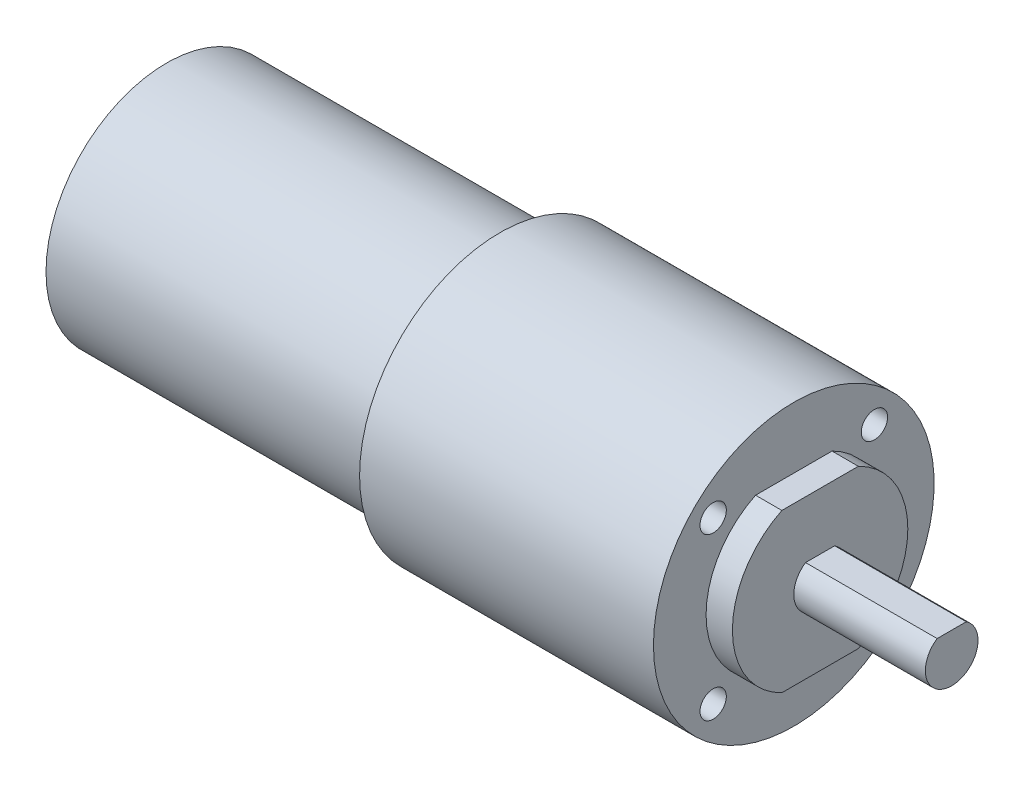
ISO-10303-21;
HEADER;
FILE_DESCRIPTION(('STEP AP214'),'2;1');
FILE_NAME('part.step','',(''),(''),'','','');
FILE_SCHEMA(('AUTOMOTIVE_DESIGN { 1 0 10303 214 1 1 1 1 }'));
ENDSEC;
DATA;
#1=APPLICATION_CONTEXT('core data for automotive mechanical design processes');
#2=APPLICATION_PROTOCOL_DEFINITION('international standard','automotive_design',2000,#1);
#3=PRODUCT_CONTEXT('',#1,'mechanical');
#4=PRODUCT('Part','Part','',(#3));
#5=PRODUCT_RELATED_PRODUCT_CATEGORY('part','',(#4));
#6=PRODUCT_DEFINITION_FORMATION('','',#4);
#7=PRODUCT_DEFINITION_CONTEXT('part definition',#1,'design');
#8=PRODUCT_DEFINITION('design','',#6,#7);
#9=PRODUCT_DEFINITION_SHAPE('','',#8);
#10=(LENGTH_UNIT() NAMED_UNIT(*) SI_UNIT(.MILLI.,.METRE.));
#11=(NAMED_UNIT(*) PLANE_ANGLE_UNIT() SI_UNIT($,.RADIAN.));
#12=(NAMED_UNIT(*) SI_UNIT($,.STERADIAN.) SOLID_ANGLE_UNIT());
#13=UNCERTAINTY_MEASURE_WITH_UNIT(LENGTH_MEASURE(1.E-05),#10,'distance_accuracy_value','');
#14=(GEOMETRIC_REPRESENTATION_CONTEXT(3) GLOBAL_UNCERTAINTY_ASSIGNED_CONTEXT((#13)) GLOBAL_UNIT_ASSIGNED_CONTEXT((#10,
#11,#12)) REPRESENTATION_CONTEXT('',''));
#15=CARTESIAN_POINT('',(0.,0.,0.));
#16=DIRECTION('',(0.,0.,1.));
#17=DIRECTION('',(1.,0.,0.));
#18=AXIS2_PLACEMENT_3D('',#15,#16,#17);
#19=CARTESIAN_POINT('',(-42.475,0.,0.));
#20=DIRECTION('',(-1.,0.,0.));
#21=DIRECTION('',(0.,0.,1.));
#22=AXIS2_PLACEMENT_3D('',#19,#20,#21);
#23=CYLINDRICAL_SURFACE('',#22,10.);
#24=CARTESIAN_POINT('',(36.5,0.,0.));
#25=DIRECTION('',(-1.,0.,0.));
#26=DIRECTION('',(0.,0.,1.));
#27=AXIS2_PLACEMENT_3D('',#24,#25,#26);
#28=CIRCLE('',#27,10.);
#29=CARTESIAN_POINT('',(36.5,9.,-4.35889894354069));
#30=VERTEX_POINT('',#29);
#31=CARTESIAN_POINT('',(36.5,-9.,-4.35889894354069));
#32=VERTEX_POINT('',#31);
#33=EDGE_CURVE('E102',#30,#32,#28,.T.);
#34=ORIENTED_EDGE('',*,*,#33,.T.);
#35=DIRECTION('',(1.,0.,0.));
#36=VECTOR('',#35,1.);
#37=CARTESIAN_POINT('',(24.7250356126079,-9.,-4.35889894354069));
#38=LINE('',#37,#36);
#39=CARTESIAN_POINT('',(33.5,-9.,-4.35889894354069));
#40=VERTEX_POINT('',#39);
#41=EDGE_CURVE('E55',#40,#32,#38,.T.);
#42=ORIENTED_EDGE('',*,*,#41,.F.);
#43=CARTESIAN_POINT('',(33.5,0.,0.));
#44=DIRECTION('',(-1.,0.,0.));
#45=DIRECTION('',(0.,0.,1.));
#46=AXIS2_PLACEMENT_3D('',#43,#44,#45);
#47=CIRCLE('',#46,10.);
#48=CARTESIAN_POINT('',(33.5,9.,-4.35889894354069));
#49=VERTEX_POINT('',#48);
#50=EDGE_CURVE('E110',#49,#40,#47,.T.);
#51=ORIENTED_EDGE('',*,*,#50,.F.);
#52=DIRECTION('',(1.,0.,0.));
#53=VECTOR('',#52,1.);
#54=CARTESIAN_POINT('',(24.7250356126079,9.,-4.35889894354069));
#55=LINE('',#54,#53);
#56=EDGE_CURVE('E150',#49,#30,#55,.T.);
#57=ORIENTED_EDGE('',*,*,#56,.T.);
#58=EDGE_LOOP('',(#34,#42,#51,#57));
#59=FACE_BOUND('',#58,.T.);
#60=ADVANCED_FACE('F32',(#59),#23,.T.);
#61=CARTESIAN_POINT('',(-38.,0.,0.));
#62=DIRECTION('',(1.,0.,0.));
#63=DIRECTION('',(0.,0.,-1.));
#64=AXIS2_PLACEMENT_3D('',#61,#62,#63);
#65=PLANE('',#64);
#66=CARTESIAN_POINT('',(-38.,0.,0.));
#67=DIRECTION('',(-1.,0.,0.));
#68=DIRECTION('',(0.,0.,1.));
#69=AXIS2_PLACEMENT_3D('',#66,#67,#68);
#70=CIRCLE('',#69,13.75);
#71=CARTESIAN_POINT('',(-38.,0.,13.75));
#72=VERTEX_POINT('',#71);
#73=EDGE_CURVE('E11',#72,#72,#70,.T.);
#74=ORIENTED_EDGE('',*,*,#73,.T.);
#75=EDGE_LOOP('',(#74));
#76=FACE_BOUND('',#75,.T.);
#77=ADVANCED_FACE('F34',(#76),#65,.F.);
#78=CARTESIAN_POINT('',(-42.475,0.,0.));
#79=DIRECTION('',(-1.,0.,0.));
#80=DIRECTION('',(0.,0.,1.));
#81=AXIS2_PLACEMENT_3D('',#78,#79,#80);
#82=CYLINDRICAL_SURFACE('',#81,13.75);
#83=ORIENTED_EDGE('',*,*,#73,.F.);
#84=EDGE_LOOP('',(#83));
#85=FACE_BOUND('',#84,.T.);
#86=CARTESIAN_POINT('',(0.,0.,0.));
#87=DIRECTION('',(-1.,0.,0.));
#88=DIRECTION('',(0.,0.,1.));
#89=AXIS2_PLACEMENT_3D('',#86,#87,#88);
#90=CIRCLE('',#89,13.75);
#91=CARTESIAN_POINT('',(0.,0.,13.75));
#92=VERTEX_POINT('',#91);
#93=EDGE_CURVE('E40',#92,#92,#90,.T.);
#94=ORIENTED_EDGE('',*,*,#93,.T.);
#95=EDGE_LOOP('',(#94));
#96=FACE_BOUND('',#95,.T.);
#97=ADVANCED_FACE('F121',(#85,#96),#82,.T.);
#98=CARTESIAN_POINT('',(0.,13.75,0.));
#99=DIRECTION('',(1.,0.,0.));
#100=DIRECTION('',(0.,0.,-1.));
#101=AXIS2_PLACEMENT_3D('',#98,#99,#100);
#102=PLANE('',#101);
#103=ORIENTED_EDGE('',*,*,#93,.F.);
#104=EDGE_LOOP('',(#103));
#105=FACE_BOUND('',#104,.T.);
#106=CARTESIAN_POINT('',(0.,0.,0.));
#107=DIRECTION('',(-1.,0.,0.));
#108=DIRECTION('',(0.,0.,1.));
#109=AXIS2_PLACEMENT_3D('',#106,#107,#108);
#110=CIRCLE('',#109,16.);
#111=CARTESIAN_POINT('',(0.,0.,16.));
#112=VERTEX_POINT('',#111);
#113=EDGE_CURVE('E116',#112,#112,#110,.T.);
#114=ORIENTED_EDGE('',*,*,#113,.T.);
#115=EDGE_LOOP('',(#114));
#116=FACE_BOUND('',#115,.T.);
#117=ADVANCED_FACE('F123',(#105,#116),#102,.F.);
#118=CARTESIAN_POINT('',(-42.475,0.,0.));
#119=DIRECTION('',(-1.,0.,0.));
#120=DIRECTION('',(0.,0.,1.));
#121=AXIS2_PLACEMENT_3D('',#118,#119,#120);
#122=CYLINDRICAL_SURFACE('',#121,16.);
#123=ORIENTED_EDGE('',*,*,#113,.F.);
#124=EDGE_LOOP('',(#123));
#125=FACE_BOUND('',#124,.T.);
#126=CARTESIAN_POINT('',(33.5,0.,0.));
#127=DIRECTION('',(-1.,0.,0.));
#128=DIRECTION('',(0.,0.,1.));
#129=AXIS2_PLACEMENT_3D('',#126,#127,#128);
#130=CIRCLE('',#129,16.);
#131=CARTESIAN_POINT('',(33.5,0.,16.));
#132=VERTEX_POINT('',#131);
#133=EDGE_CURVE('E113',#132,#132,#130,.T.);
#134=ORIENTED_EDGE('',*,*,#133,.T.);
#135=EDGE_LOOP('',(#134));
#136=FACE_BOUND('',#135,.T.);
#137=ADVANCED_FACE('F126',(#125,#136),#122,.T.);
#138=CARTESIAN_POINT('',(33.5,16.,0.));
#139=DIRECTION('',(-1.,0.,0.));
#140=DIRECTION('',(0.,0.,1.));
#141=AXIS2_PLACEMENT_3D('',#138,#139,#140);
#142=PLANE('',#141);
#143=CARTESIAN_POINT('',(33.5,-9.19238815542514,9.1923881554251));
#144=DIRECTION('',(1.,0.,0.));
#145=DIRECTION('',(0.,0.,1.));
#146=AXIS2_PLACEMENT_3D('',#143,#144,#145);
#147=CIRCLE('',#146,1.5);
#148=CARTESIAN_POINT('',(33.5,-9.19238815542514,10.6923881554251));
#149=VERTEX_POINT('',#148);
#150=EDGE_CURVE('E193',#149,#149,#147,.T.);
#151=ORIENTED_EDGE('',*,*,#150,.F.);
#152=EDGE_LOOP('',(#151));
#153=FACE_BOUND('',#152,.T.);
#154=CARTESIAN_POINT('',(33.5,-9.192388155425,-9.19238815542523));
#155=DIRECTION('',(1.,0.,0.));
#156=DIRECTION('',(0.,-1.,0.));
#157=AXIS2_PLACEMENT_3D('',#154,#155,#156);
#158=CIRCLE('',#157,1.5);
#159=CARTESIAN_POINT('',(33.5,-10.692388155425,-9.19238815542525));
#160=VERTEX_POINT('',#159);
#161=EDGE_CURVE('E187',#160,#160,#158,.T.);
#162=ORIENTED_EDGE('',*,*,#161,.F.);
#163=EDGE_LOOP('',(#162));
#164=FACE_BOUND('',#163,.T.);
#165=CARTESIAN_POINT('',(33.5,9.19238815542507,9.19238815542517));
#166=DIRECTION('',(1.,0.,0.));
#167=DIRECTION('',(0.,1.,0.));
#168=AXIS2_PLACEMENT_3D('',#165,#166,#167);
#169=CIRCLE('',#168,1.5);
#170=CARTESIAN_POINT('',(33.5,10.6923881554251,9.19238815542517));
#171=VERTEX_POINT('',#170);
#172=EDGE_CURVE('E181',#171,#171,#169,.T.);
#173=ORIENTED_EDGE('',*,*,#172,.F.);
#174=EDGE_LOOP('',(#173));
#175=FACE_BOUND('',#174,.T.);
#176=CARTESIAN_POINT('',(33.5,9.19238815542514,-9.1923881554251));
#177=DIRECTION('',(1.,0.,0.));
#178=DIRECTION('',(0.,0.,-1.));
#179=AXIS2_PLACEMENT_3D('',#176,#177,#178);
#180=CIRCLE('',#179,1.5);
#181=CARTESIAN_POINT('',(33.5,9.19238815542514,-10.6923881554251));
#182=VERTEX_POINT('',#181);
#183=EDGE_CURVE('E175',#182,#182,#180,.T.);
#184=ORIENTED_EDGE('',*,*,#183,.F.);
#185=EDGE_LOOP('',(#184));
#186=FACE_BOUND('',#185,.T.);
#187=ORIENTED_EDGE('',*,*,#133,.F.);
#188=EDGE_LOOP('',(#187));
#189=FACE_BOUND('',#188,.T.);
#190=ORIENTED_EDGE('',*,*,#50,.T.);
#191=DIRECTION('',(0.,0.,1.));
#192=VECTOR('',#191,1.);
#193=CARTESIAN_POINT('',(33.5,-9.,4.35889894354069));
#194=LINE('',#193,#192);
#195=CARTESIAN_POINT('',(33.5,-9.,4.35889894354069));
#196=VERTEX_POINT('',#195);
#197=EDGE_CURVE('E144',#40,#196,#194,.T.);
#198=ORIENTED_EDGE('',*,*,#197,.T.);
#199=CARTESIAN_POINT('',(33.5,9.,4.35889894354069));
#200=VERTEX_POINT('',#199);
#201=EDGE_CURVE('E109',#196,#200,#47,.T.);
#202=ORIENTED_EDGE('',*,*,#201,.T.);
#203=DIRECTION('',(0.,0.,-1.));
#204=VECTOR('',#203,1.);
#205=CARTESIAN_POINT('',(33.5,9.,4.35889894354069));
#206=LINE('',#205,#204);
#207=EDGE_CURVE('E147',#200,#49,#206,.T.);
#208=ORIENTED_EDGE('',*,*,#207,.T.);
#209=EDGE_LOOP('',(#190,#198,#202,#208));
#210=FACE_BOUND('',#209,.T.);
#211=ADVANCED_FACE('F132',(#153,#164,#175,#186,#189,#210),#142,.F.);
#212=ORIENTED_EDGE('',*,*,#201,.F.);
#213=DIRECTION('',(1.,0.,0.));
#214=VECTOR('',#213,1.);
#215=CARTESIAN_POINT('',(24.7250356126079,-9.,4.35889894354069));
#216=LINE('',#215,#214);
#217=CARTESIAN_POINT('',(36.5,-9.,4.35889894354069));
#218=VERTEX_POINT('',#217);
#219=EDGE_CURVE('E153',#196,#218,#216,.T.);
#220=ORIENTED_EDGE('',*,*,#219,.T.);
#221=CARTESIAN_POINT('',(36.5,9.,4.35889894354069));
#222=VERTEX_POINT('',#221);
#223=EDGE_CURVE('E99',#218,#222,#28,.T.);
#224=ORIENTED_EDGE('',*,*,#223,.T.);
#225=DIRECTION('',(1.,0.,0.));
#226=VECTOR('',#225,1.);
#227=CARTESIAN_POINT('',(24.7250356126079,9.,4.35889894354069));
#228=LINE('',#227,#226);
#229=EDGE_CURVE('E104',#200,#222,#228,.T.);
#230=ORIENTED_EDGE('',*,*,#229,.F.);
#231=EDGE_LOOP('',(#212,#220,#224,#230));
#232=FACE_BOUND('',#231,.T.);
#233=ADVANCED_FACE('F138',(#232),#23,.T.);
#234=CARTESIAN_POINT('',(36.5,10.,0.));
#235=DIRECTION('',(-1.,0.,0.));
#236=DIRECTION('',(0.,0.,1.));
#237=AXIS2_PLACEMENT_3D('',#234,#235,#236);
#238=PLANE('',#237);
#239=ORIENTED_EDGE('',*,*,#223,.F.);
#240=DIRECTION('',(0.,0.,1.));
#241=VECTOR('',#240,1.);
#242=CARTESIAN_POINT('',(36.5,-9.,4.35889894354069));
#243=LINE('',#242,#241);
#244=EDGE_CURVE('E169',#32,#218,#243,.T.);
#245=ORIENTED_EDGE('',*,*,#244,.F.);
#246=ORIENTED_EDGE('',*,*,#33,.F.);
#247=DIRECTION('',(0.,0.,-1.));
#248=VECTOR('',#247,1.);
#249=CARTESIAN_POINT('',(36.5,9.,4.35889894354069));
#250=LINE('',#249,#248);
#251=EDGE_CURVE('E152',#222,#30,#250,.T.);
#252=ORIENTED_EDGE('',*,*,#251,.F.);
#253=EDGE_LOOP('',(#239,#245,#246,#252));
#254=FACE_BOUND('',#253,.T.);
#255=CARTESIAN_POINT('',(36.5,0.,0.));
#256=DIRECTION('',(-1.,0.,0.));
#257=DIRECTION('',(0.,0.,1.));
#258=AXIS2_PLACEMENT_3D('',#255,#256,#257);
#259=CIRCLE('',#258,3.00000000000001);
#260=CARTESIAN_POINT('',(36.5,2.5,-1.65831239517771));
#261=VERTEX_POINT('',#260);
#262=CARTESIAN_POINT('',(36.5,2.5,1.65831239517771));
#263=VERTEX_POINT('',#262);
#264=EDGE_CURVE('E96',#261,#263,#259,.T.);
#265=ORIENTED_EDGE('',*,*,#264,.T.);
#266=DIRECTION('',(0.,0.,-1.));
#267=VECTOR('',#266,1.);
#268=CARTESIAN_POINT('',(36.5,2.5,1.65831239517771));
#269=LINE('',#268,#267);
#270=EDGE_CURVE('E86',#263,#261,#269,.T.);
#271=ORIENTED_EDGE('',*,*,#270,.T.);
#272=EDGE_LOOP('',(#265,#271));
#273=FACE_BOUND('',#272,.T.);
#274=ADVANCED_FACE('F95',(#254,#273),#238,.F.);
#275=CARTESIAN_POINT('',(-42.475,0.,0.));
#276=DIRECTION('',(-1.,0.,0.));
#277=DIRECTION('',(0.,0.,1.));
#278=AXIS2_PLACEMENT_3D('',#275,#276,#277);
#279=CYLINDRICAL_SURFACE('',#278,3.00000000000001);
#280=CARTESIAN_POINT('',(51.5,0.,0.));
#281=DIRECTION('',(-1.,0.,0.));
#282=DIRECTION('',(0.,0.,1.));
#283=AXIS2_PLACEMENT_3D('',#280,#281,#282);
#284=CIRCLE('',#283,3.00000000000001);
#285=CARTESIAN_POINT('',(51.5,2.5,-1.65831239517771));
#286=VERTEX_POINT('',#285);
#287=CARTESIAN_POINT('',(51.5,2.5,1.65831239517771));
#288=VERTEX_POINT('',#287);
#289=EDGE_CURVE('E100',#286,#288,#284,.T.);
#290=ORIENTED_EDGE('',*,*,#289,.T.);
#291=DIRECTION('',(1.,0.,0.));
#292=VECTOR('',#291,1.);
#293=CARTESIAN_POINT('',(33.1458980337503,2.5,1.65831239517771));
#294=LINE('',#293,#292);
#295=EDGE_CURVE('E47',#263,#288,#294,.T.);
#296=ORIENTED_EDGE('',*,*,#295,.F.);
#297=ORIENTED_EDGE('',*,*,#264,.F.);
#298=DIRECTION('',(1.,0.,0.));
#299=VECTOR('',#298,1.);
#300=CARTESIAN_POINT('',(33.1458980337503,2.5,-1.65831239517771));
#301=LINE('',#300,#299);
#302=EDGE_CURVE('E83',#261,#286,#301,.T.);
#303=ORIENTED_EDGE('',*,*,#302,.T.);
#304=EDGE_LOOP('',(#290,#296,#297,#303));
#305=FACE_BOUND('',#304,.T.);
#306=ADVANCED_FACE('F98',(#305),#279,.T.);
#307=CARTESIAN_POINT('',(51.5,3.00000000000001,0.));
#308=DIRECTION('',(-1.,0.,0.));
#309=DIRECTION('',(0.,0.,1.));
#310=AXIS2_PLACEMENT_3D('',#307,#308,#309);
#311=PLANE('',#310);
#312=ORIENTED_EDGE('',*,*,#289,.F.);
#313=DIRECTION('',(0.,0.,-1.));
#314=VECTOR('',#313,1.);
#315=CARTESIAN_POINT('',(51.5,2.5,1.65831239517771));
#316=LINE('',#315,#314);
#317=EDGE_CURVE('E87',#288,#286,#316,.T.);
#318=ORIENTED_EDGE('',*,*,#317,.F.);
#319=EDGE_LOOP('',(#312,#318));
#320=FACE_BOUND('',#319,.T.);
#321=ADVANCED_FACE('F245',(#320),#311,.F.);
#322=CARTESIAN_POINT('',(24.7250356126079,9.,4.35889894354069));
#323=DIRECTION('',(0.,-1.,0.));
#324=DIRECTION('',(0.,0.,-1.));
#325=AXIS2_PLACEMENT_3D('',#322,#323,#324);
#326=PLANE('',#325);
#327=ORIENTED_EDGE('',*,*,#229,.T.);
#328=ORIENTED_EDGE('',*,*,#251,.T.);
#329=ORIENTED_EDGE('',*,*,#56,.F.);
#330=ORIENTED_EDGE('',*,*,#207,.F.);
#331=EDGE_LOOP('',(#327,#328,#329,#330));
#332=FACE_BOUND('',#331,.T.);
#333=ADVANCED_FACE('F165',(#332),#326,.F.);
#334=CARTESIAN_POINT('',(24.7250356126079,-9.,4.35889894354069));
#335=DIRECTION('',(0.,1.,0.));
#336=DIRECTION('',(0.,0.,1.));
#337=AXIS2_PLACEMENT_3D('',#334,#335,#336);
#338=PLANE('',#337);
#339=ORIENTED_EDGE('',*,*,#41,.T.);
#340=ORIENTED_EDGE('',*,*,#244,.T.);
#341=ORIENTED_EDGE('',*,*,#219,.F.);
#342=ORIENTED_EDGE('',*,*,#197,.F.);
#343=EDGE_LOOP('',(#339,#340,#341,#342));
#344=FACE_BOUND('',#343,.T.);
#345=ADVANCED_FACE('F226',(#344),#338,.F.);
#346=CARTESIAN_POINT('',(33.1458980337503,2.5,1.65831239517771));
#347=DIRECTION('',(0.,-1.,0.));
#348=DIRECTION('',(0.,0.,-1.));
#349=AXIS2_PLACEMENT_3D('',#346,#347,#348);
#350=PLANE('',#349);
#351=ORIENTED_EDGE('',*,*,#295,.T.);
#352=ORIENTED_EDGE('',*,*,#317,.T.);
#353=ORIENTED_EDGE('',*,*,#302,.F.);
#354=ORIENTED_EDGE('',*,*,#270,.F.);
#355=EDGE_LOOP('',(#351,#352,#353,#354));
#356=FACE_BOUND('',#355,.T.);
#357=ADVANCED_FACE('F85',(#356),#350,.F.);
#358=CARTESIAN_POINT('',(28.5,9.19238815542514,-9.1923881554251));
#359=DIRECTION('',(1.,0.,0.));
#360=DIRECTION('',(0.,0.,-1.));
#361=AXIS2_PLACEMENT_3D('',#358,#359,#360);
#362=CYLINDRICAL_SURFACE('',#361,1.5);
#363=CARTESIAN_POINT('',(28.5,9.19238815542514,-9.1923881554251));
#364=DIRECTION('',(1.,0.,0.));
#365=DIRECTION('',(0.,0.,-1.));
#366=AXIS2_PLACEMENT_3D('',#363,#364,#365);
#367=CIRCLE('',#366,1.5);
#368=CARTESIAN_POINT('',(28.5,9.19238815542514,-10.6923881554251));
#369=VERTEX_POINT('',#368);
#370=EDGE_CURVE('E174',#369,#369,#367,.T.);
#371=ORIENTED_EDGE('',*,*,#370,.F.);
#372=EDGE_LOOP('',(#371));
#373=FACE_BOUND('',#372,.T.);
#374=ORIENTED_EDGE('',*,*,#183,.T.);
#375=EDGE_LOOP('',(#374));
#376=FACE_BOUND('',#375,.T.);
#377=ADVANCED_FACE('F214',(#373,#376),#362,.F.);
#378=CARTESIAN_POINT('',(28.5,9.19238815542514,-9.1923881554251));
#379=DIRECTION('',(1.,0.,0.));
#380=DIRECTION('',(0.,0.,-1.));
#381=AXIS2_PLACEMENT_3D('',#378,#379,#380);
#382=PLANE('',#381);
#383=ORIENTED_EDGE('',*,*,#370,.T.);
#384=EDGE_LOOP('',(#383));
#385=FACE_BOUND('',#384,.T.);
#386=ADVANCED_FACE('F216',(#385),#382,.T.);
#387=CARTESIAN_POINT('',(28.5,9.19238815542507,9.19238815542517));
#388=DIRECTION('',(1.,0.,0.));
#389=DIRECTION('',(0.,0.,-1.));
#390=AXIS2_PLACEMENT_3D('',#387,#388,#389);
#391=CYLINDRICAL_SURFACE('',#390,1.5);
#392=CARTESIAN_POINT('',(28.5,9.19238815542507,9.19238815542517));
#393=DIRECTION('',(1.,0.,0.));
#394=DIRECTION('',(0.,1.,0.));
#395=AXIS2_PLACEMENT_3D('',#392,#393,#394);
#396=CIRCLE('',#395,1.5);
#397=CARTESIAN_POINT('',(28.5,10.6923881554251,9.19238815542517));
#398=VERTEX_POINT('',#397);
#399=EDGE_CURVE('E178',#398,#398,#396,.T.);
#400=ORIENTED_EDGE('',*,*,#399,.F.);
#401=EDGE_LOOP('',(#400));
#402=FACE_BOUND('',#401,.T.);
#403=ORIENTED_EDGE('',*,*,#172,.T.);
#404=EDGE_LOOP('',(#403));
#405=FACE_BOUND('',#404,.T.);
#406=ADVANCED_FACE('F223',(#402,#405),#391,.F.);
#407=CARTESIAN_POINT('',(28.5,9.19238815542507,9.19238815542517));
#408=DIRECTION('',(1.,0.,0.));
#409=DIRECTION('',(0.,1.,0.));
#410=AXIS2_PLACEMENT_3D('',#407,#408,#409);
#411=PLANE('',#410);
#412=ORIENTED_EDGE('',*,*,#399,.T.);
#413=EDGE_LOOP('',(#412));
#414=FACE_BOUND('',#413,.T.);
#415=ADVANCED_FACE('F303',(#414),#411,.T.);
#416=CARTESIAN_POINT('',(28.5,-9.192388155425,-9.19238815542523));
#417=DIRECTION('',(1.,0.,0.));
#418=DIRECTION('',(0.,0.,-1.));
#419=AXIS2_PLACEMENT_3D('',#416,#417,#418);
#420=CYLINDRICAL_SURFACE('',#419,1.5);
#421=CARTESIAN_POINT('',(28.5,-9.192388155425,-9.19238815542523));
#422=DIRECTION('',(1.,0.,0.));
#423=DIRECTION('',(0.,-1.,0.));
#424=AXIS2_PLACEMENT_3D('',#421,#422,#423);
#425=CIRCLE('',#424,1.5);
#426=CARTESIAN_POINT('',(28.5,-10.692388155425,-9.19238815542525));
#427=VERTEX_POINT('',#426);
#428=EDGE_CURVE('E190',#427,#427,#425,.T.);
#429=ORIENTED_EDGE('',*,*,#428,.F.);
#430=EDGE_LOOP('',(#429));
#431=FACE_BOUND('',#430,.T.);
#432=ORIENTED_EDGE('',*,*,#161,.T.);
#433=EDGE_LOOP('',(#432));
#434=FACE_BOUND('',#433,.T.);
#435=ADVANCED_FACE('F312',(#431,#434),#420,.F.);
#436=CARTESIAN_POINT('',(28.5,-9.192388155425,-9.19238815542523));
#437=DIRECTION('',(1.,0.,0.));
#438=DIRECTION('',(0.,-1.,0.));
#439=AXIS2_PLACEMENT_3D('',#436,#437,#438);
#440=PLANE('',#439);
#441=ORIENTED_EDGE('',*,*,#428,.T.);
#442=EDGE_LOOP('',(#441));
#443=FACE_BOUND('',#442,.T.);
#444=ADVANCED_FACE('F204',(#443),#440,.T.);
#445=CARTESIAN_POINT('',(28.5,-9.19238815542514,9.1923881554251));
#446=DIRECTION('',(1.,0.,0.));
#447=DIRECTION('',(0.,0.,-1.));
#448=AXIS2_PLACEMENT_3D('',#445,#446,#447);
#449=CYLINDRICAL_SURFACE('',#448,1.5);
#450=CARTESIAN_POINT('',(28.5,-9.19238815542514,9.1923881554251));
#451=DIRECTION('',(1.,0.,0.));
#452=DIRECTION('',(0.,0.,1.));
#453=AXIS2_PLACEMENT_3D('',#450,#451,#452);
#454=CIRCLE('',#453,1.5);
#455=CARTESIAN_POINT('',(28.5,-9.19238815542514,10.6923881554251));
#456=VERTEX_POINT('',#455);
#457=EDGE_CURVE('E184',#456,#456,#454,.T.);
#458=ORIENTED_EDGE('',*,*,#457,.F.);
#459=EDGE_LOOP('',(#458));
#460=FACE_BOUND('',#459,.T.);
#461=ORIENTED_EDGE('',*,*,#150,.T.);
#462=EDGE_LOOP('',(#461));
#463=FACE_BOUND('',#462,.T.);
#464=ADVANCED_FACE('F201',(#460,#463),#449,.F.);
#465=CARTESIAN_POINT('',(28.5,-9.19238815542514,9.1923881554251));
#466=DIRECTION('',(1.,0.,0.));
#467=DIRECTION('',(0.,0.,1.));
#468=AXIS2_PLACEMENT_3D('',#465,#466,#467);
#469=PLANE('',#468);
#470=ORIENTED_EDGE('',*,*,#457,.T.);
#471=EDGE_LOOP('',(#470));
#472=FACE_BOUND('',#471,.T.);
#473=ADVANCED_FACE('F199',(#472),#469,.T.);
#474=CLOSED_SHELL('',(#60,#77,#97,#117,#137,#211,#233,#274,#306,#321,#333,#345,#357,#377,#386,
#406,#415,#435,#444,#464,#473));
#475=MANIFOLD_SOLID_BREP('B2',#474);
#476=ADVANCED_BREP_SHAPE_REPRESENTATION('',(#18,#475),#14);
#477=SHAPE_DEFINITION_REPRESENTATION(#9,#476);
ENDSEC;
END-ISO-10303-21;
